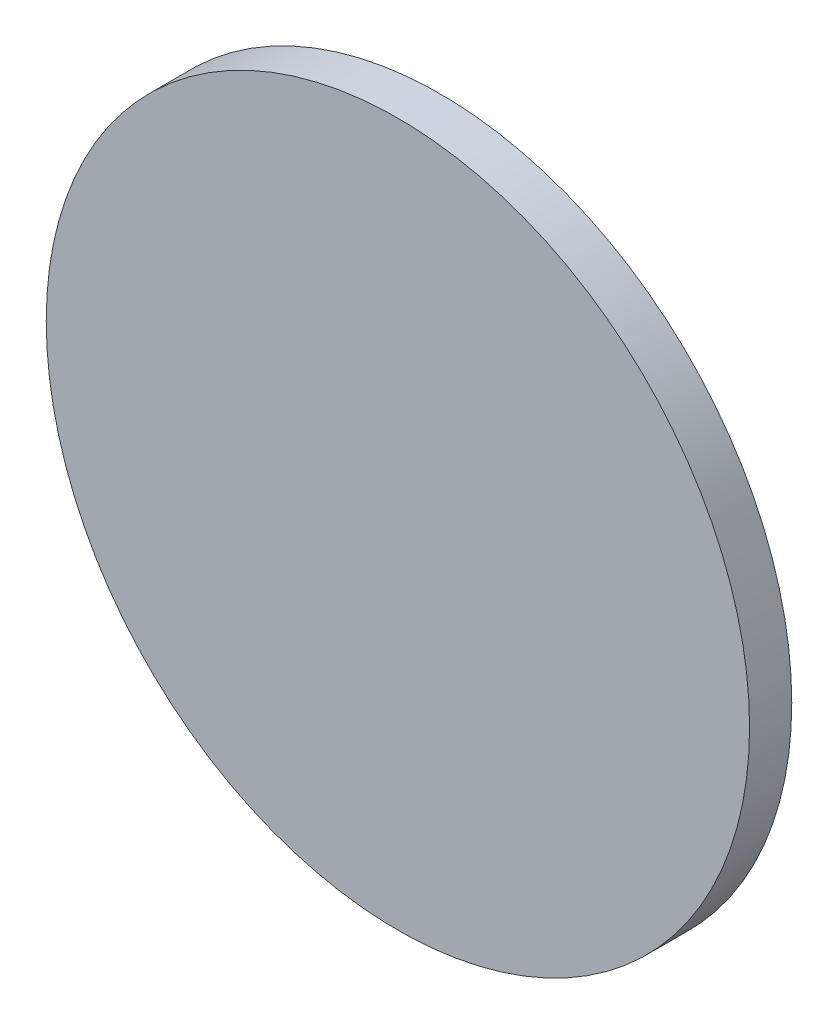
ISO-10303-21;
HEADER;
FILE_DESCRIPTION(('STEP AP214'),'2;1');
FILE_NAME('part.step','',(''),(''),'','','');
FILE_SCHEMA(('AUTOMOTIVE_DESIGN { 1 0 10303 214 1 1 1 1 }'));
ENDSEC;
DATA;
#1=APPLICATION_CONTEXT('core data for automotive mechanical design processes');
#2=APPLICATION_PROTOCOL_DEFINITION('international standard','automotive_design',2000,#1);
#3=PRODUCT_CONTEXT('',#1,'mechanical');
#4=PRODUCT('Part','Part','',(#3));
#5=PRODUCT_RELATED_PRODUCT_CATEGORY('part','',(#4));
#6=PRODUCT_DEFINITION_FORMATION('','',#4);
#7=PRODUCT_DEFINITION_CONTEXT('part definition',#1,'design');
#8=PRODUCT_DEFINITION('design','',#6,#7);
#9=PRODUCT_DEFINITION_SHAPE('','',#8);
#10=(LENGTH_UNIT() NAMED_UNIT(*) SI_UNIT(.MILLI.,.METRE.));
#11=(NAMED_UNIT(*) PLANE_ANGLE_UNIT() SI_UNIT($,.RADIAN.));
#12=(NAMED_UNIT(*) SI_UNIT($,.STERADIAN.) SOLID_ANGLE_UNIT());
#13=UNCERTAINTY_MEASURE_WITH_UNIT(LENGTH_MEASURE(1.E-05),#10,'distance_accuracy_value','');
#14=(GEOMETRIC_REPRESENTATION_CONTEXT(3) GLOBAL_UNCERTAINTY_ASSIGNED_CONTEXT((#13)) GLOBAL_UNIT_ASSIGNED_CONTEXT((#10,
#11,#12)) REPRESENTATION_CONTEXT('',''));
#15=CARTESIAN_POINT('',(0.,0.,0.));
#16=DIRECTION('',(0.,0.,1.));
#17=DIRECTION('',(1.,0.,0.));
#18=AXIS2_PLACEMENT_3D('',#15,#16,#17);
#19=CARTESIAN_POINT('',(-60.4482829781527,42.969994749465,6.40770612576134));
#20=DIRECTION('',(0.,0.,-1.));
#21=DIRECTION('',(-1.,0.,0.));
#22=AXIS2_PLACEMENT_3D('',#19,#20,#21);
#23=PLANE('',#22);
#24=CARTESIAN_POINT('',(-35.0482829781527,17.569994749465,6.40770612576134));
#25=DIRECTION('',(0.,0.,1.));
#26=DIRECTION('',(1.,0.,0.));
#27=AXIS2_PLACEMENT_3D('',#24,#25,#26);
#28=CIRCLE('',#27,2.5);
#29=CARTESIAN_POINT('',(-32.5482829781527,17.569994749465,6.40770612576134));
#30=VERTEX_POINT('',#29);
#31=EDGE_CURVE('E10',#30,#30,#28,.T.);
#32=ORIENTED_EDGE('',*,*,#31,.F.);
#33=EDGE_LOOP('',(#32));
#34=FACE_BOUND('',#33,.T.);
#35=ADVANCED_FACE('F30',(#34),#23,.T.);
#36=CARTESIAN_POINT('',(-35.0482829781527,17.569994749465,6.40770612576134));
#37=DIRECTION('',(0.,0.,1.));
#38=DIRECTION('',(1.,0.,0.));
#39=AXIS2_PLACEMENT_3D('',#36,#37,#38);
#40=CYLINDRICAL_SURFACE('',#39,2.5);
#41=ORIENTED_EDGE('',*,*,#31,.T.);
#42=EDGE_LOOP('',(#41));
#43=FACE_BOUND('',#42,.T.);
#44=CARTESIAN_POINT('',(-35.0482829781527,17.569994749465,6.70770612576134));
#45=DIRECTION('',(0.,0.,1.));
#46=DIRECTION('',(1.,0.,0.));
#47=AXIS2_PLACEMENT_3D('',#44,#45,#46);
#48=CIRCLE('',#47,2.5);
#49=CARTESIAN_POINT('',(-32.5482829781527,17.569994749465,6.70770612576134));
#50=VERTEX_POINT('',#49);
#51=EDGE_CURVE('E33',#50,#50,#48,.T.);
#52=ORIENTED_EDGE('',*,*,#51,.F.);
#53=EDGE_LOOP('',(#52));
#54=FACE_BOUND('',#53,.T.);
#55=ADVANCED_FACE('F44',(#43,#54),#40,.T.);
#56=CARTESIAN_POINT('',(-60.4482829781527,42.969994749465,6.70770612576134));
#57=DIRECTION('',(0.,0.,-1.));
#58=DIRECTION('',(-1.,0.,0.));
#59=AXIS2_PLACEMENT_3D('',#56,#57,#58);
#60=PLANE('',#59);
#61=ORIENTED_EDGE('',*,*,#51,.T.);
#62=EDGE_LOOP('',(#61));
#63=FACE_BOUND('',#62,.T.);
#64=ADVANCED_FACE('F42',(#63),#60,.F.);
#65=CLOSED_SHELL('',(#35,#55,#64));
#66=MANIFOLD_SOLID_BREP('B2',#65);
#67=ADVANCED_BREP_SHAPE_REPRESENTATION('',(#18,#66),#14);
#68=SHAPE_DEFINITION_REPRESENTATION(#9,#67);
ENDSEC;
END-ISO-10303-21;
